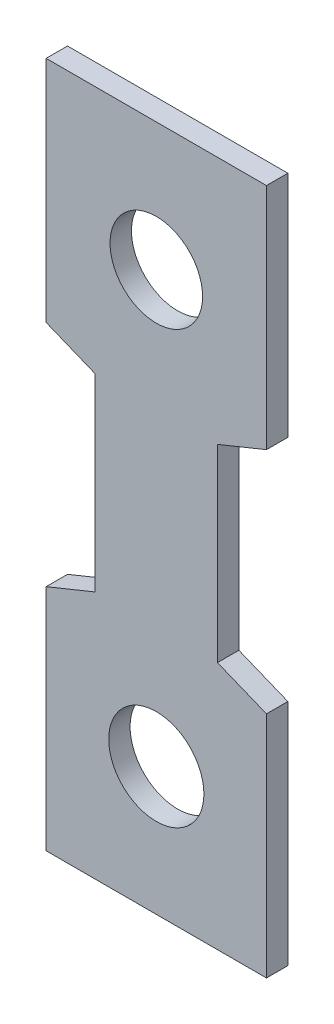
ISO-10303-21;
HEADER;
FILE_DESCRIPTION(('STEP AP214'),'2;1');
FILE_NAME('part.step','',(''),(''),'','','');
FILE_SCHEMA(('AUTOMOTIVE_DESIGN { 1 0 10303 214 1 1 1 1 }'));
ENDSEC;
DATA;
#1=APPLICATION_CONTEXT('core data for automotive mechanical design processes');
#2=APPLICATION_PROTOCOL_DEFINITION('international standard','automotive_design',2000,#1);
#3=PRODUCT_CONTEXT('',#1,'mechanical');
#4=PRODUCT('Part','Part','',(#3));
#5=PRODUCT_RELATED_PRODUCT_CATEGORY('part','',(#4));
#6=PRODUCT_DEFINITION_FORMATION('','',#4);
#7=PRODUCT_DEFINITION_CONTEXT('part definition',#1,'design');
#8=PRODUCT_DEFINITION('design','',#6,#7);
#9=PRODUCT_DEFINITION_SHAPE('','',#8);
#10=(LENGTH_UNIT() NAMED_UNIT(*) SI_UNIT(.MILLI.,.METRE.));
#11=(NAMED_UNIT(*) PLANE_ANGLE_UNIT() SI_UNIT($,.RADIAN.));
#12=(NAMED_UNIT(*) SI_UNIT($,.STERADIAN.) SOLID_ANGLE_UNIT());
#13=UNCERTAINTY_MEASURE_WITH_UNIT(LENGTH_MEASURE(1.E-05),#10,'distance_accuracy_value','');
#14=(GEOMETRIC_REPRESENTATION_CONTEXT(3) GLOBAL_UNCERTAINTY_ASSIGNED_CONTEXT((#13)) GLOBAL_UNIT_ASSIGNED_CONTEXT((#10,
#11,#12)) REPRESENTATION_CONTEXT('',''));
#15=CARTESIAN_POINT('',(0.,0.,0.));
#16=DIRECTION('',(0.,0.,1.));
#17=DIRECTION('',(1.,0.,0.));
#18=AXIS2_PLACEMENT_3D('',#15,#16,#17);
#19=CARTESIAN_POINT('',(0.,0.,1.0922));
#20=DIRECTION('',(0.,0.,-1.));
#21=DIRECTION('',(-1.,0.,0.));
#22=AXIS2_PLACEMENT_3D('',#19,#20,#21);
#23=PLANE('',#22);
#24=DIRECTION('',(0.,-1.,0.));
#25=VECTOR('',#24,1.);
#26=CARTESIAN_POINT('',(-5.6261,16.8275,1.0922));
#27=LINE('',#26,#25);
#28=CARTESIAN_POINT('',(-5.6261,28.5115,1.0922));
#29=VERTEX_POINT('',#28);
#30=CARTESIAN_POINT('',(-5.6261,16.8275,1.0922));
#31=VERTEX_POINT('',#30);
#32=EDGE_CURVE('E179',#29,#31,#27,.T.);
#33=ORIENTED_EDGE('',*,*,#32,.T.);
#34=DIRECTION('',(0.926517818130893,-0.376250890611529,0.));
#35=VECTOR('',#34,1.);
#36=CARTESIAN_POINT('',(-3.1242,15.8115,1.0922));
#37=LINE('',#36,#35);
#38=CARTESIAN_POINT('',(-3.1242,15.8115,1.0922));
#39=VERTEX_POINT('',#38);
#40=EDGE_CURVE('E107',#31,#39,#37,.T.);
#41=ORIENTED_EDGE('',*,*,#40,.T.);
#42=DIRECTION('',(0.,-1.,0.));
#43=VECTOR('',#42,1.);
#44=CARTESIAN_POINT('',(-3.1242,6.1595,1.0922));
#45=LINE('',#44,#43);
#46=CARTESIAN_POINT('',(-3.1242,6.1595,1.0922));
#47=VERTEX_POINT('',#46);
#48=EDGE_CURVE('E206',#39,#47,#45,.T.);
#49=ORIENTED_EDGE('',*,*,#48,.T.);
#50=DIRECTION('',(-0.926517818130893,-0.376250890611529,0.));
#51=VECTOR('',#50,1.);
#52=CARTESIAN_POINT('',(-5.6261,5.1435,1.0922));
#53=LINE('',#52,#51);
#54=CARTESIAN_POINT('',(-5.6261,5.1435,1.0922));
#55=VERTEX_POINT('',#54);
#56=EDGE_CURVE('E225',#47,#55,#53,.T.);
#57=ORIENTED_EDGE('',*,*,#56,.T.);
#58=DIRECTION('',(0.,-1.,0.));
#59=VECTOR('',#58,1.);
#60=CARTESIAN_POINT('',(-5.6261,-6.5405,1.0922));
#61=LINE('',#60,#59);
#62=CARTESIAN_POINT('',(-5.6261,-6.5405,1.0922));
#63=VERTEX_POINT('',#62);
#64=EDGE_CURVE('E222',#55,#63,#61,.T.);
#65=ORIENTED_EDGE('',*,*,#64,.T.);
#66=DIRECTION('',(1.,0.,0.));
#67=VECTOR('',#66,1.);
#68=CARTESIAN_POINT('',(5.6261,-6.5405,1.0922));
#69=LINE('',#68,#67);
#70=CARTESIAN_POINT('',(5.6261,-6.5405,1.0922));
#71=VERTEX_POINT('',#70);
#72=EDGE_CURVE('E224',#63,#71,#69,.T.);
#73=ORIENTED_EDGE('',*,*,#72,.T.);
#74=DIRECTION('',(0.,1.,0.));
#75=VECTOR('',#74,1.);
#76=CARTESIAN_POINT('',(5.6261,5.1435,1.0922));
#77=LINE('',#76,#75);
#78=CARTESIAN_POINT('',(5.6261,5.1435,1.0922));
#79=VERTEX_POINT('',#78);
#80=EDGE_CURVE('E227',#71,#79,#77,.T.);
#81=ORIENTED_EDGE('',*,*,#80,.T.);
#82=DIRECTION('',(-0.926517818130894,0.376250890611529,0.));
#83=VECTOR('',#82,1.);
#84=CARTESIAN_POINT('',(3.1242,6.1595,1.0922));
#85=LINE('',#84,#83);
#86=CARTESIAN_POINT('',(3.1242,6.1595,1.0922));
#87=VERTEX_POINT('',#86);
#88=EDGE_CURVE('E233',#79,#87,#85,.T.);
#89=ORIENTED_EDGE('',*,*,#88,.T.);
#90=DIRECTION('',(0.,1.,0.));
#91=VECTOR('',#90,1.);
#92=CARTESIAN_POINT('',(3.1242,15.8115,1.0922));
#93=LINE('',#92,#91);
#94=CARTESIAN_POINT('',(3.1242,15.8115,1.0922));
#95=VERTEX_POINT('',#94);
#96=EDGE_CURVE('E138',#87,#95,#93,.T.);
#97=ORIENTED_EDGE('',*,*,#96,.T.);
#98=DIRECTION('',(0.926517818130893,0.376250890611529,0.));
#99=VECTOR('',#98,1.);
#100=CARTESIAN_POINT('',(5.6261,16.8275,1.0922));
#101=LINE('',#100,#99);
#102=CARTESIAN_POINT('',(5.6261,16.8275,1.0922));
#103=VERTEX_POINT('',#102);
#104=EDGE_CURVE('E132',#95,#103,#101,.T.);
#105=ORIENTED_EDGE('',*,*,#104,.T.);
#106=DIRECTION('',(0.,1.,0.));
#107=VECTOR('',#106,1.);
#108=CARTESIAN_POINT('',(5.6261,28.5115,1.0922));
#109=LINE('',#108,#107);
#110=CARTESIAN_POINT('',(5.6261,28.5115,1.0922));
#111=VERTEX_POINT('',#110);
#112=EDGE_CURVE('E136',#103,#111,#109,.T.);
#113=ORIENTED_EDGE('',*,*,#112,.T.);
#114=DIRECTION('',(-1.,0.,0.));
#115=VECTOR('',#114,1.);
#116=CARTESIAN_POINT('',(-5.6261,28.5115,1.0922));
#117=LINE('',#116,#115);
#118=EDGE_CURVE('E52',#111,#29,#117,.T.);
#119=ORIENTED_EDGE('',*,*,#118,.T.);
#120=EDGE_LOOP('',(#33,#41,#49,#57,#65,#73,#81,#89,#97,#105,#113,#119));
#121=FACE_BOUND('',#120,.T.);
#122=CARTESIAN_POINT('',(0.,0.,1.0922));
#123=DIRECTION('',(0.,0.,1.));
#124=DIRECTION('',(1.,0.,0.));
#125=AXIS2_PLACEMENT_3D('',#122,#123,#124);
#126=CIRCLE('',#125,2.43087073521856);
#127=CARTESIAN_POINT('',(2.43087073521856,0.,1.0922));
#128=VERTEX_POINT('',#127);
#129=EDGE_CURVE('E160',#128,#128,#126,.T.);
#130=ORIENTED_EDGE('',*,*,#129,.F.);
#131=EDGE_LOOP('',(#130));
#132=FACE_BOUND('',#131,.T.);
#133=CARTESIAN_POINT('',(0.,21.971,1.0922));
#134=DIRECTION('',(0.,0.,1.));
#135=DIRECTION('',(1.,0.,0.));
#136=AXIS2_PLACEMENT_3D('',#133,#134,#135);
#137=CIRCLE('',#136,2.36295847969978);
#138=CARTESIAN_POINT('',(2.36295847969978,21.971,1.0922));
#139=VERTEX_POINT('',#138);
#140=EDGE_CURVE('E274',#139,#139,#137,.T.);
#141=ORIENTED_EDGE('',*,*,#140,.F.);
#142=EDGE_LOOP('',(#141));
#143=FACE_BOUND('',#142,.T.);
#144=ADVANCED_FACE('F35',(#121,#132,#143),#23,.F.);
#145=CARTESIAN_POINT('',(0.,0.,0.));
#146=DIRECTION('',(0.,0.,-1.));
#147=DIRECTION('',(-1.,0.,0.));
#148=AXIS2_PLACEMENT_3D('',#145,#146,#147);
#149=PLANE('',#148);
#150=CARTESIAN_POINT('',(0.,0.,0.));
#151=DIRECTION('',(0.,0.,1.));
#152=DIRECTION('',(1.,0.,0.));
#153=AXIS2_PLACEMENT_3D('',#150,#151,#152);
#154=CIRCLE('',#153,2.43087073521856);
#155=CARTESIAN_POINT('',(2.43087073521856,0.,0.));
#156=VERTEX_POINT('',#155);
#157=EDGE_CURVE('E279',#156,#156,#154,.T.);
#158=ORIENTED_EDGE('',*,*,#157,.T.);
#159=EDGE_LOOP('',(#158));
#160=FACE_BOUND('',#159,.T.);
#161=DIRECTION('',(0.,-1.,0.));
#162=VECTOR('',#161,1.);
#163=CARTESIAN_POINT('',(-5.6261,16.8275,0.));
#164=LINE('',#163,#162);
#165=CARTESIAN_POINT('',(-5.6261,28.5115,0.));
#166=VERTEX_POINT('',#165);
#167=CARTESIAN_POINT('',(-5.6261,16.8275,0.));
#168=VERTEX_POINT('',#167);
#169=EDGE_CURVE('E156',#166,#168,#164,.T.);
#170=ORIENTED_EDGE('',*,*,#169,.F.);
#171=DIRECTION('',(-1.,0.,0.));
#172=VECTOR('',#171,1.);
#173=CARTESIAN_POINT('',(-5.6261,28.5115,0.));
#174=LINE('',#173,#172);
#175=CARTESIAN_POINT('',(5.6261,28.5115,0.));
#176=VERTEX_POINT('',#175);
#177=EDGE_CURVE('E99',#176,#166,#174,.T.);
#178=ORIENTED_EDGE('',*,*,#177,.F.);
#179=DIRECTION('',(0.,1.,0.));
#180=VECTOR('',#179,1.);
#181=CARTESIAN_POINT('',(5.6261,28.5115,0.));
#182=LINE('',#181,#180);
#183=CARTESIAN_POINT('',(5.6261,16.8275,0.));
#184=VERTEX_POINT('',#183);
#185=EDGE_CURVE('E93',#184,#176,#182,.T.);
#186=ORIENTED_EDGE('',*,*,#185,.F.);
#187=DIRECTION('',(0.926517818130893,0.376250890611529,0.));
#188=VECTOR('',#187,1.);
#189=CARTESIAN_POINT('',(5.6261,16.8275,0.));
#190=LINE('',#189,#188);
#191=CARTESIAN_POINT('',(3.1242,15.8115,0.));
#192=VERTEX_POINT('',#191);
#193=EDGE_CURVE('E146',#192,#184,#190,.T.);
#194=ORIENTED_EDGE('',*,*,#193,.F.);
#195=DIRECTION('',(0.,1.,0.));
#196=VECTOR('',#195,1.);
#197=CARTESIAN_POINT('',(3.1242,15.8115,0.));
#198=LINE('',#197,#196);
#199=CARTESIAN_POINT('',(3.1242,6.1595,0.));
#200=VERTEX_POINT('',#199);
#201=EDGE_CURVE('E174',#200,#192,#198,.T.);
#202=ORIENTED_EDGE('',*,*,#201,.F.);
#203=DIRECTION('',(-0.926517818130894,0.376250890611529,0.));
#204=VECTOR('',#203,1.);
#205=CARTESIAN_POINT('',(3.1242,6.1595,0.));
#206=LINE('',#205,#204);
#207=CARTESIAN_POINT('',(5.6261,5.1435,0.));
#208=VERTEX_POINT('',#207);
#209=EDGE_CURVE('E172',#208,#200,#206,.T.);
#210=ORIENTED_EDGE('',*,*,#209,.F.);
#211=DIRECTION('',(0.,1.,0.));
#212=VECTOR('',#211,1.);
#213=CARTESIAN_POINT('',(5.6261,5.1435,0.));
#214=LINE('',#213,#212);
#215=CARTESIAN_POINT('',(5.6261,-6.5405,0.));
#216=VERTEX_POINT('',#215);
#217=EDGE_CURVE('E170',#216,#208,#214,.T.);
#218=ORIENTED_EDGE('',*,*,#217,.F.);
#219=DIRECTION('',(1.,0.,0.));
#220=VECTOR('',#219,1.);
#221=CARTESIAN_POINT('',(5.6261,-6.5405,0.));
#222=LINE('',#221,#220);
#223=CARTESIAN_POINT('',(-5.6261,-6.5405,0.));
#224=VERTEX_POINT('',#223);
#225=EDGE_CURVE('E168',#224,#216,#222,.T.);
#226=ORIENTED_EDGE('',*,*,#225,.F.);
#227=DIRECTION('',(0.,-1.,0.));
#228=VECTOR('',#227,1.);
#229=CARTESIAN_POINT('',(-5.6261,-6.5405,0.));
#230=LINE('',#229,#228);
#231=CARTESIAN_POINT('',(-5.6261,5.1435,0.));
#232=VERTEX_POINT('',#231);
#233=EDGE_CURVE('E166',#232,#224,#230,.T.);
#234=ORIENTED_EDGE('',*,*,#233,.F.);
#235=DIRECTION('',(-0.926517818130893,-0.376250890611529,0.));
#236=VECTOR('',#235,1.);
#237=CARTESIAN_POINT('',(-5.6261,5.1435,0.));
#238=LINE('',#237,#236);
#239=CARTESIAN_POINT('',(-3.1242,6.1595,0.));
#240=VERTEX_POINT('',#239);
#241=EDGE_CURVE('E164',#240,#232,#238,.T.);
#242=ORIENTED_EDGE('',*,*,#241,.F.);
#243=DIRECTION('',(0.,-1.,0.));
#244=VECTOR('',#243,1.);
#245=CARTESIAN_POINT('',(-3.1242,6.1595,0.));
#246=LINE('',#245,#244);
#247=CARTESIAN_POINT('',(-3.1242,15.8115,0.));
#248=VERTEX_POINT('',#247);
#249=EDGE_CURVE('E162',#248,#240,#246,.T.);
#250=ORIENTED_EDGE('',*,*,#249,.F.);
#251=DIRECTION('',(0.926517818130893,-0.376250890611529,0.));
#252=VECTOR('',#251,1.);
#253=CARTESIAN_POINT('',(-3.1242,15.8115,0.));
#254=LINE('',#253,#252);
#255=EDGE_CURVE('E159',#168,#248,#254,.T.);
#256=ORIENTED_EDGE('',*,*,#255,.F.);
#257=EDGE_LOOP('',(#170,#178,#186,#194,#202,#210,#218,#226,#234,#242,#250,#256));
#258=FACE_BOUND('',#257,.T.);
#259=CARTESIAN_POINT('',(0.,21.971,0.));
#260=DIRECTION('',(0.,0.,1.));
#261=DIRECTION('',(1.,0.,0.));
#262=AXIS2_PLACEMENT_3D('',#259,#260,#261);
#263=CIRCLE('',#262,2.36295847969978);
#264=CARTESIAN_POINT('',(2.36295847969978,21.971,0.));
#265=VERTEX_POINT('',#264);
#266=EDGE_CURVE('E277',#265,#265,#263,.T.);
#267=ORIENTED_EDGE('',*,*,#266,.T.);
#268=EDGE_LOOP('',(#267));
#269=FACE_BOUND('',#268,.T.);
#270=ADVANCED_FACE('F210',(#160,#258,#269),#149,.T.);
#271=CARTESIAN_POINT('',(-5.6261,16.8275,1.0922));
#272=DIRECTION('',(1.,0.,0.));
#273=DIRECTION('',(0.,0.,-1.));
#274=AXIS2_PLACEMENT_3D('',#271,#272,#273);
#275=PLANE('',#274);
#276=ORIENTED_EDGE('',*,*,#169,.T.);
#277=DIRECTION('',(0.,0.,-1.));
#278=VECTOR('',#277,1.);
#279=CARTESIAN_POINT('',(-5.6261,16.8275,1.0922));
#280=LINE('',#279,#278);
#281=EDGE_CURVE('E11',#31,#168,#280,.T.);
#282=ORIENTED_EDGE('',*,*,#281,.F.);
#283=ORIENTED_EDGE('',*,*,#32,.F.);
#284=DIRECTION('',(0.,0.,-1.));
#285=VECTOR('',#284,1.);
#286=CARTESIAN_POINT('',(-5.6261,28.5115,1.0922));
#287=LINE('',#286,#285);
#288=EDGE_CURVE('E152',#29,#166,#287,.T.);
#289=ORIENTED_EDGE('',*,*,#288,.T.);
#290=EDGE_LOOP('',(#276,#282,#283,#289));
#291=FACE_BOUND('',#290,.T.);
#292=ADVANCED_FACE('F37',(#291),#275,.F.);
#293=CARTESIAN_POINT('',(-3.1242,15.8115,1.0922));
#294=DIRECTION('',(0.376250890611529,0.926517818130893,0.));
#295=DIRECTION('',(-0.926517818130893,0.376250890611529,0.));
#296=AXIS2_PLACEMENT_3D('',#293,#294,#295);
#297=PLANE('',#296);
#298=ORIENTED_EDGE('',*,*,#255,.T.);
#299=DIRECTION('',(0.,0.,-1.));
#300=VECTOR('',#299,1.);
#301=CARTESIAN_POINT('',(-3.1242,15.8115,1.0922));
#302=LINE('',#301,#300);
#303=EDGE_CURVE('E44',#39,#248,#302,.T.);
#304=ORIENTED_EDGE('',*,*,#303,.F.);
#305=ORIENTED_EDGE('',*,*,#40,.F.);
#306=ORIENTED_EDGE('',*,*,#281,.T.);
#307=EDGE_LOOP('',(#298,#304,#305,#306));
#308=FACE_BOUND('',#307,.T.);
#309=ADVANCED_FACE('F374',(#308),#297,.F.);
#310=CARTESIAN_POINT('',(-3.1242,6.1595,1.0922));
#311=DIRECTION('',(1.,0.,0.));
#312=DIRECTION('',(0.,0.,-1.));
#313=AXIS2_PLACEMENT_3D('',#310,#311,#312);
#314=PLANE('',#313);
#315=ORIENTED_EDGE('',*,*,#249,.T.);
#316=DIRECTION('',(0.,0.,-1.));
#317=VECTOR('',#316,1.);
#318=CARTESIAN_POINT('',(-3.1242,6.1595,1.0922));
#319=LINE('',#318,#317);
#320=EDGE_CURVE('E198',#47,#240,#319,.T.);
#321=ORIENTED_EDGE('',*,*,#320,.F.);
#322=ORIENTED_EDGE('',*,*,#48,.F.);
#323=ORIENTED_EDGE('',*,*,#303,.T.);
#324=EDGE_LOOP('',(#315,#321,#322,#323));
#325=FACE_BOUND('',#324,.T.);
#326=ADVANCED_FACE('F204',(#325),#314,.F.);
#327=CARTESIAN_POINT('',(-5.6261,5.1435,1.0922));
#328=DIRECTION('',(0.376250890611529,-0.926517818130893,0.));
#329=DIRECTION('',(0.926517818130893,0.376250890611529,0.));
#330=AXIS2_PLACEMENT_3D('',#327,#328,#329);
#331=PLANE('',#330);
#332=ORIENTED_EDGE('',*,*,#241,.T.);
#333=DIRECTION('',(0.,0.,-1.));
#334=VECTOR('',#333,1.);
#335=CARTESIAN_POINT('',(-5.6261,5.1435,1.0922));
#336=LINE('',#335,#334);
#337=EDGE_CURVE('E195',#55,#232,#336,.T.);
#338=ORIENTED_EDGE('',*,*,#337,.F.);
#339=ORIENTED_EDGE('',*,*,#56,.F.);
#340=ORIENTED_EDGE('',*,*,#320,.T.);
#341=EDGE_LOOP('',(#332,#338,#339,#340));
#342=FACE_BOUND('',#341,.T.);
#343=ADVANCED_FACE('F216',(#342),#331,.F.);
#344=CARTESIAN_POINT('',(-5.6261,-6.5405,1.0922));
#345=DIRECTION('',(1.,0.,0.));
#346=DIRECTION('',(0.,0.,-1.));
#347=AXIS2_PLACEMENT_3D('',#344,#345,#346);
#348=PLANE('',#347);
#349=ORIENTED_EDGE('',*,*,#233,.T.);
#350=DIRECTION('',(0.,0.,-1.));
#351=VECTOR('',#350,1.);
#352=CARTESIAN_POINT('',(-5.6261,-6.5405,1.0922));
#353=LINE('',#352,#351);
#354=EDGE_CURVE('E192',#63,#224,#353,.T.);
#355=ORIENTED_EDGE('',*,*,#354,.F.);
#356=ORIENTED_EDGE('',*,*,#64,.F.);
#357=ORIENTED_EDGE('',*,*,#337,.T.);
#358=EDGE_LOOP('',(#349,#355,#356,#357));
#359=FACE_BOUND('',#358,.T.);
#360=ADVANCED_FACE('F220',(#359),#348,.F.);
#361=CARTESIAN_POINT('',(5.6261,-6.5405,1.0922));
#362=DIRECTION('',(0.,1.,0.));
#363=DIRECTION('',(0.,0.,1.));
#364=AXIS2_PLACEMENT_3D('',#361,#362,#363);
#365=PLANE('',#364);
#366=ORIENTED_EDGE('',*,*,#225,.T.);
#367=DIRECTION('',(0.,0.,-1.));
#368=VECTOR('',#367,1.);
#369=CARTESIAN_POINT('',(5.6261,-6.5405,1.0922));
#370=LINE('',#369,#368);
#371=EDGE_CURVE('E189',#71,#216,#370,.T.);
#372=ORIENTED_EDGE('',*,*,#371,.F.);
#373=ORIENTED_EDGE('',*,*,#72,.F.);
#374=ORIENTED_EDGE('',*,*,#354,.T.);
#375=EDGE_LOOP('',(#366,#372,#373,#374));
#376=FACE_BOUND('',#375,.T.);
#377=ADVANCED_FACE('F339',(#376),#365,.F.);
#378=CARTESIAN_POINT('',(5.6261,5.1435,1.0922));
#379=DIRECTION('',(-1.,0.,0.));
#380=DIRECTION('',(0.,-1.,0.));
#381=AXIS2_PLACEMENT_3D('',#378,#379,#380);
#382=PLANE('',#381);
#383=ORIENTED_EDGE('',*,*,#217,.T.);
#384=DIRECTION('',(0.,0.,-1.));
#385=VECTOR('',#384,1.);
#386=CARTESIAN_POINT('',(5.6261,5.1435,1.0922));
#387=LINE('',#386,#385);
#388=EDGE_CURVE('E186',#79,#208,#387,.T.);
#389=ORIENTED_EDGE('',*,*,#388,.F.);
#390=ORIENTED_EDGE('',*,*,#80,.F.);
#391=ORIENTED_EDGE('',*,*,#371,.T.);
#392=EDGE_LOOP('',(#383,#389,#390,#391));
#393=FACE_BOUND('',#392,.T.);
#394=ADVANCED_FACE('F330',(#393),#382,.F.);
#395=CARTESIAN_POINT('',(3.1242,6.1595,1.0922));
#396=DIRECTION('',(-0.376250890611529,-0.926517818130894,0.));
#397=DIRECTION('',(0.926517818130894,-0.376250890611529,0.));
#398=AXIS2_PLACEMENT_3D('',#395,#396,#397);
#399=PLANE('',#398);
#400=ORIENTED_EDGE('',*,*,#209,.T.);
#401=DIRECTION('',(0.,0.,-1.));
#402=VECTOR('',#401,1.);
#403=CARTESIAN_POINT('',(3.1242,6.1595,1.0922));
#404=LINE('',#403,#402);
#405=EDGE_CURVE('E183',#87,#200,#404,.T.);
#406=ORIENTED_EDGE('',*,*,#405,.F.);
#407=ORIENTED_EDGE('',*,*,#88,.F.);
#408=ORIENTED_EDGE('',*,*,#388,.T.);
#409=EDGE_LOOP('',(#400,#406,#407,#408));
#410=FACE_BOUND('',#409,.T.);
#411=ADVANCED_FACE('F239',(#410),#399,.F.);
#412=CARTESIAN_POINT('',(3.1242,15.8115,1.0922));
#413=DIRECTION('',(-1.,0.,0.));
#414=DIRECTION('',(0.,0.,1.));
#415=AXIS2_PLACEMENT_3D('',#412,#413,#414);
#416=PLANE('',#415);
#417=ORIENTED_EDGE('',*,*,#201,.T.);
#418=DIRECTION('',(0.,0.,-1.));
#419=VECTOR('',#418,1.);
#420=CARTESIAN_POINT('',(3.1242,15.8115,1.0922));
#421=LINE('',#420,#419);
#422=EDGE_CURVE('E147',#95,#192,#421,.T.);
#423=ORIENTED_EDGE('',*,*,#422,.F.);
#424=ORIENTED_EDGE('',*,*,#96,.F.);
#425=ORIENTED_EDGE('',*,*,#405,.T.);
#426=EDGE_LOOP('',(#417,#423,#424,#425));
#427=FACE_BOUND('',#426,.T.);
#428=ADVANCED_FACE('F243',(#427),#416,.F.);
#429=CARTESIAN_POINT('',(5.6261,16.8275,1.0922));
#430=DIRECTION('',(-0.376250890611529,0.926517818130893,0.));
#431=DIRECTION('',(-0.926517818130893,-0.376250890611529,0.));
#432=AXIS2_PLACEMENT_3D('',#429,#430,#431);
#433=PLANE('',#432);
#434=ORIENTED_EDGE('',*,*,#193,.T.);
#435=DIRECTION('',(0.,0.,-1.));
#436=VECTOR('',#435,1.);
#437=CARTESIAN_POINT('',(5.6261,16.8275,1.0922));
#438=LINE('',#437,#436);
#439=EDGE_CURVE('E143',#103,#184,#438,.T.);
#440=ORIENTED_EDGE('',*,*,#439,.F.);
#441=ORIENTED_EDGE('',*,*,#104,.F.);
#442=ORIENTED_EDGE('',*,*,#422,.T.);
#443=EDGE_LOOP('',(#434,#440,#441,#442));
#444=FACE_BOUND('',#443,.T.);
#445=ADVANCED_FACE('F144',(#444),#433,.F.);
#446=CARTESIAN_POINT('',(5.6261,28.5115,1.0922));
#447=DIRECTION('',(-1.,0.,0.));
#448=DIRECTION('',(0.,-1.,0.));
#449=AXIS2_PLACEMENT_3D('',#446,#447,#448);
#450=PLANE('',#449);
#451=ORIENTED_EDGE('',*,*,#185,.T.);
#452=DIRECTION('',(0.,0.,-1.));
#453=VECTOR('',#452,1.);
#454=CARTESIAN_POINT('',(5.6261,28.5115,1.0922));
#455=LINE('',#454,#453);
#456=EDGE_CURVE('E148',#111,#176,#455,.T.);
#457=ORIENTED_EDGE('',*,*,#456,.F.);
#458=ORIENTED_EDGE('',*,*,#112,.F.);
#459=ORIENTED_EDGE('',*,*,#439,.T.);
#460=EDGE_LOOP('',(#451,#457,#458,#459));
#461=FACE_BOUND('',#460,.T.);
#462=ADVANCED_FACE('F150',(#461),#450,.F.);
#463=CARTESIAN_POINT('',(-5.6261,28.5115,1.0922));
#464=DIRECTION('',(0.,-1.,0.));
#465=DIRECTION('',(0.,0.,-1.));
#466=AXIS2_PLACEMENT_3D('',#463,#464,#465);
#467=PLANE('',#466);
#468=ORIENTED_EDGE('',*,*,#177,.T.);
#469=ORIENTED_EDGE('',*,*,#288,.F.);
#470=ORIENTED_EDGE('',*,*,#118,.F.);
#471=ORIENTED_EDGE('',*,*,#456,.T.);
#472=EDGE_LOOP('',(#468,#469,#470,#471));
#473=FACE_BOUND('',#472,.T.);
#474=ADVANCED_FACE('F247',(#473),#467,.F.);
#475=CARTESIAN_POINT('',(0.,0.,1.0922));
#476=DIRECTION('',(0.,0.,-1.));
#477=DIRECTION('',(-1.,0.,0.));
#478=AXIS2_PLACEMENT_3D('',#475,#476,#477);
#479=CYLINDRICAL_SURFACE('',#478,2.43087073521856);
#480=ORIENTED_EDGE('',*,*,#129,.T.);
#481=EDGE_LOOP('',(#480));
#482=FACE_BOUND('',#481,.T.);
#483=ORIENTED_EDGE('',*,*,#157,.F.);
#484=EDGE_LOOP('',(#483));
#485=FACE_BOUND('',#484,.T.);
#486=ADVANCED_FACE('F249',(#482,#485),#479,.F.);
#487=CARTESIAN_POINT('',(0.,21.971,1.0922));
#488=DIRECTION('',(0.,0.,-1.));
#489=DIRECTION('',(-1.,0.,0.));
#490=AXIS2_PLACEMENT_3D('',#487,#488,#489);
#491=CYLINDRICAL_SURFACE('',#490,2.36295847969978);
#492=ORIENTED_EDGE('',*,*,#140,.T.);
#493=EDGE_LOOP('',(#492));
#494=FACE_BOUND('',#493,.T.);
#495=ORIENTED_EDGE('',*,*,#266,.F.);
#496=EDGE_LOOP('',(#495));
#497=FACE_BOUND('',#496,.T.);
#498=ADVANCED_FACE('F255',(#494,#497),#491,.F.);
#499=CLOSED_SHELL('',(#144,#270,#292,#309,#326,#343,#360,#377,#394,#411,#428,#445,#462,#474,
#486,#498));
#500=MANIFOLD_SOLID_BREP('B2',#499);
#501=ADVANCED_BREP_SHAPE_REPRESENTATION('',(#18,#500),#14);
#502=SHAPE_DEFINITION_REPRESENTATION(#9,#501);
ENDSEC;
END-ISO-10303-21;
